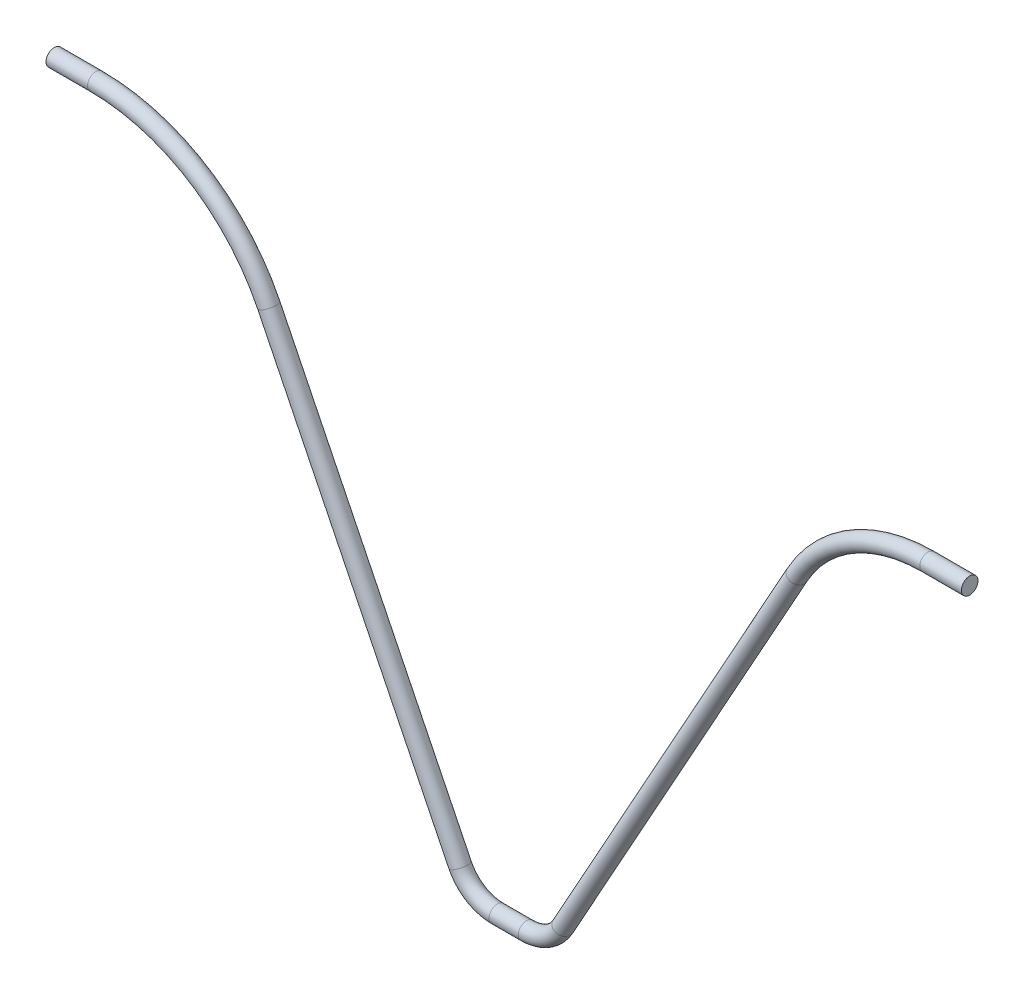
ISO-10303-21;
HEADER;
FILE_DESCRIPTION(('STEP AP214'),'2;1');
FILE_NAME('part.step','',(''),(''),'','','');
FILE_SCHEMA(('AUTOMOTIVE_DESIGN { 1 0 10303 214 1 1 1 1 }'));
ENDSEC;
DATA;
#1=APPLICATION_CONTEXT('core data for automotive mechanical design processes');
#2=APPLICATION_PROTOCOL_DEFINITION('international standard','automotive_design',2000,#1);
#3=PRODUCT_CONTEXT('',#1,'mechanical');
#4=PRODUCT('Part','Part','',(#3));
#5=PRODUCT_RELATED_PRODUCT_CATEGORY('part','',(#4));
#6=PRODUCT_DEFINITION_FORMATION('','',#4);
#7=PRODUCT_DEFINITION_CONTEXT('part definition',#1,'design');
#8=PRODUCT_DEFINITION('design','',#6,#7);
#9=PRODUCT_DEFINITION_SHAPE('','',#8);
#10=(LENGTH_UNIT() NAMED_UNIT(*) SI_UNIT(.MILLI.,.METRE.));
#11=(NAMED_UNIT(*) PLANE_ANGLE_UNIT() SI_UNIT($,.RADIAN.));
#12=(NAMED_UNIT(*) SI_UNIT($,.STERADIAN.) SOLID_ANGLE_UNIT());
#13=UNCERTAINTY_MEASURE_WITH_UNIT(LENGTH_MEASURE(1.E-05),#10,'distance_accuracy_value','');
#14=(GEOMETRIC_REPRESENTATION_CONTEXT(3) GLOBAL_UNCERTAINTY_ASSIGNED_CONTEXT((#13)) GLOBAL_UNIT_ASSIGNED_CONTEXT((#10,
#11,#12)) REPRESENTATION_CONTEXT('',''));
#15=CARTESIAN_POINT('',(0.,0.,0.));
#16=DIRECTION('',(0.,0.,1.));
#17=DIRECTION('',(1.,0.,0.));
#18=AXIS2_PLACEMENT_3D('',#15,#16,#17);
#19=CARTESIAN_POINT('',(-110.,81.0000000000004,0.));
#20=DIRECTION('',(-1.,0.,0.));
#21=DIRECTION('',(0.,0.,1.));
#22=AXIS2_PLACEMENT_3D('',#19,#20,#21);
#23=PLANE('',#22);
#24=CARTESIAN_POINT('',(-110.,81.0000000000004,0.));
#25=DIRECTION('',(-1.,0.,0.));
#26=DIRECTION('',(0.,0.,1.));
#27=AXIS2_PLACEMENT_3D('',#24,#25,#26);
#28=CIRCLE('',#27,2.);
#29=CARTESIAN_POINT('',(-110.,81.0000000000004,2.));
#30=VERTEX_POINT('',#29);
#31=EDGE_CURVE('E81',#30,#30,#28,.T.);
#32=ORIENTED_EDGE('',*,*,#31,.T.);
#33=EDGE_LOOP('',(#32));
#34=FACE_BOUND('',#33,.T.);
#35=ADVANCED_FACE('F47',(#34),#23,.T.);
#36=CARTESIAN_POINT('',(110.,81.0000000000002,0.));
#37=DIRECTION('',(-1.,0.,0.));
#38=DIRECTION('',(0.,0.,1.));
#39=AXIS2_PLACEMENT_3D('',#36,#37,#38);
#40=PLANE('',#39);
#41=CARTESIAN_POINT('',(110.,81.0000000000002,0.));
#42=DIRECTION('',(-1.,0.,0.));
#43=DIRECTION('',(0.,0.,1.));
#44=AXIS2_PLACEMENT_3D('',#41,#42,#43);
#45=CIRCLE('',#44,2.);
#46=CARTESIAN_POINT('',(110.,81.0000000000002,2.));
#47=VERTEX_POINT('',#46);
#48=EDGE_CURVE('E11',#47,#47,#45,.T.);
#49=ORIENTED_EDGE('',*,*,#48,.F.);
#50=EDGE_LOOP('',(#49));
#51=FACE_BOUND('',#50,.T.);
#52=ADVANCED_FACE('F89',(#51),#40,.F.);
#53=CARTESIAN_POINT('',(-110.,81.0000000000004,0.));
#54=DIRECTION('',(1.,0.,0.));
#55=DIRECTION('',(0.,0.,-1.));
#56=AXIS2_PLACEMENT_3D('',#53,#54,#55);
#57=CYLINDRICAL_SURFACE('',#56,2.);
#58=CARTESIAN_POINT('',(-100.,81.0000000000004,0.));
#59=DIRECTION('',(-1.,0.,0.));
#60=DIRECTION('',(0.,0.,1.));
#61=AXIS2_PLACEMENT_3D('',#58,#59,#60);
#62=CIRCLE('',#61,2.);
#63=CARTESIAN_POINT('',(-100.,83.0000000000004,0.));
#64=VERTEX_POINT('',#63);
#65=EDGE_CURVE('E78',#64,#64,#62,.T.);
#66=ORIENTED_EDGE('',*,*,#65,.T.);
#67=EDGE_LOOP('',(#66));
#68=FACE_BOUND('',#67,.T.);
#69=ORIENTED_EDGE('',*,*,#31,.F.);
#70=EDGE_LOOP('',(#69));
#71=FACE_BOUND('',#70,.T.);
#72=ADVANCED_FACE('F86',(#68,#71),#57,.T.);
#73=CARTESIAN_POINT('',(-100.,34.6994535519126,0.));
#74=DIRECTION('',(0.,0.,-1.));
#75=DIRECTION('',(-1.,0.,0.));
#76=AXIS2_PLACEMENT_3D('',#73,#74,#75);
#77=TOROIDAL_SURFACE('',#76,46.3005464480878,2.);
#78=CARTESIAN_POINT('',(-58.4473662808127,55.1229506175617,0.));
#79=DIRECTION('',(-0.441107041545351,0.897454499068955,0.));
#80=DIRECTION('',(0.,0.,1.));
#81=AXIS2_PLACEMENT_3D('',#78,#79,#80);
#82=CIRCLE('',#81,2.);
#83=CARTESIAN_POINT('',(-56.6524572826747,56.0051647006525,0.));
#84=VERTEX_POINT('',#83);
#85=EDGE_CURVE('E75',#84,#84,#82,.T.);
#86=CARTESIAN_POINT('',(-100.,34.6994535519126,0.));
#87=DIRECTION('',(0.,0.,-1.));
#88=DIRECTION('',(-1.,0.,0.));
#89=AXIS2_PLACEMENT_3D('',#86,#87,#88);
#90=CIRCLE('',#89,48.3005464480878);
#91=EDGE_CURVE('',#64,#84,#90,.T.);
#92=ORIENTED_EDGE('',*,*,#65,.F.);
#93=ORIENTED_EDGE('',*,*,#85,.T.);
#94=ORIENTED_EDGE('',*,*,#91,.T.);
#95=ORIENTED_EDGE('',*,*,#91,.F.);
#96=EDGE_LOOP('',(#92,#94,#93,#95));
#97=FACE_BOUND('',#96,.T.);
#98=ADVANCED_FACE('F88',(#97),#77,.T.);
#99=CARTESIAN_POINT('',(-58.4473662808127,55.1229506175617,0.));
#100=DIRECTION('',(0.441107041545352,-0.897454499068954,0.));
#101=DIRECTION('',(0.897454499068954,0.441107041545352,0.));
#102=AXIS2_PLACEMENT_3D('',#99,#100,#101);
#103=CYLINDRICAL_SURFACE('',#102,2.);
#104=CARTESIAN_POINT('',(-12.4745449906895,-38.4110704154533,0.));
#105=DIRECTION('',(-0.441107041545351,0.897454499068954,0.));
#106=DIRECTION('',(0.,0.,1.));
#107=AXIS2_PLACEMENT_3D('',#104,#105,#106);
#108=CIRCLE('',#107,2.);
#109=CARTESIAN_POINT('',(-14.2694539888275,-39.2932844985441,0.));
#110=VERTEX_POINT('',#109);
#111=EDGE_CURVE('E72',#110,#110,#108,.T.);
#112=ORIENTED_EDGE('',*,*,#111,.T.);
#113=EDGE_LOOP('',(#112));
#114=FACE_BOUND('',#113,.T.);
#115=ORIENTED_EDGE('',*,*,#85,.F.);
#116=EDGE_LOOP('',(#115));
#117=FACE_BOUND('',#116,.T.);
#118=ADVANCED_FACE('F96',(#114,#117),#103,.T.);
#119=CARTESIAN_POINT('',(-3.5,-33.9999999999998,0.));
#120=DIRECTION('',(0.,0.,1.));
#121=DIRECTION('',(1.,0.,0.));
#122=AXIS2_PLACEMENT_3D('',#119,#120,#121);
#123=TOROIDAL_SURFACE('',#122,10.,2.);
#124=CARTESIAN_POINT('',(-3.50000000000013,-43.9999999999997,0.));
#125=DIRECTION('',(-1.,0.,0.));
#126=DIRECTION('',(0.,0.,1.));
#127=AXIS2_PLACEMENT_3D('',#124,#125,#126);
#128=CIRCLE('',#127,2.);
#129=CARTESIAN_POINT('',(-3.50000000000015,-45.9999999999998,0.));
#130=VERTEX_POINT('',#129);
#131=EDGE_CURVE('E69',#130,#130,#128,.T.);
#132=CARTESIAN_POINT('',(-3.5,-33.9999999999998,0.));
#133=DIRECTION('',(0.,0.,1.));
#134=DIRECTION('',(1.,0.,0.));
#135=AXIS2_PLACEMENT_3D('',#132,#133,#134);
#136=CIRCLE('',#135,12.);
#137=EDGE_CURVE('',#110,#130,#136,.T.);
#138=ORIENTED_EDGE('',*,*,#111,.F.);
#139=ORIENTED_EDGE('',*,*,#131,.T.);
#140=ORIENTED_EDGE('',*,*,#137,.T.);
#141=ORIENTED_EDGE('',*,*,#137,.F.);
#142=EDGE_LOOP('',(#138,#140,#139,#141));
#143=FACE_BOUND('',#142,.T.);
#144=ADVANCED_FACE('F121',(#143),#123,.T.);
#145=CARTESIAN_POINT('',(-3.50000000000011,-43.9999999999997,0.));
#146=DIRECTION('',(1.,0.,0.));
#147=DIRECTION('',(0.,0.,-1.));
#148=AXIS2_PLACEMENT_3D('',#145,#146,#147);
#149=CYLINDRICAL_SURFACE('',#148,2.);
#150=CARTESIAN_POINT('',(3.49999999999989,-43.9999999999997,0.));
#151=DIRECTION('',(-1.,0.,0.));
#152=DIRECTION('',(0.,0.,1.));
#153=AXIS2_PLACEMENT_3D('',#150,#151,#152);
#154=CIRCLE('',#153,2.);
#155=CARTESIAN_POINT('',(3.49999999999987,-45.9999999999996,0.));
#156=VERTEX_POINT('',#155);
#157=EDGE_CURVE('E66',#156,#156,#154,.T.);
#158=ORIENTED_EDGE('',*,*,#157,.T.);
#159=EDGE_LOOP('',(#158));
#160=FACE_BOUND('',#159,.T.);
#161=ORIENTED_EDGE('',*,*,#131,.F.);
#162=EDGE_LOOP('',(#161));
#163=FACE_BOUND('',#162,.T.);
#164=ADVANCED_FACE('F117',(#160,#163),#149,.T.);
#165=CARTESIAN_POINT('',(3.5,-33.9999999999998,0.));
#166=DIRECTION('',(0.,0.,1.));
#167=DIRECTION('',(1.,0.,0.));
#168=AXIS2_PLACEMENT_3D('',#165,#166,#167);
#169=TOROIDAL_SURFACE('',#168,9.99999999999983,2.);
#170=CARTESIAN_POINT('',(12.2423402455972,-38.8550475826926,0.));
#171=DIRECTION('',(-0.485504758269285,-0.874234024559719,0.));
#172=DIRECTION('',(0.,0.,1.));
#173=AXIS2_PLACEMENT_3D('',#170,#171,#172);
#174=CIRCLE('',#173,2.);
#175=CARTESIAN_POINT('',(13.9908082947165,-39.8260570992311,0.));
#176=VERTEX_POINT('',#175);
#177=EDGE_CURVE('E61',#176,#176,#174,.T.);
#178=CARTESIAN_POINT('',(3.5,-33.9999999999998,0.));
#179=DIRECTION('',(0.,0.,1.));
#180=DIRECTION('',(1.,0.,0.));
#181=AXIS2_PLACEMENT_3D('',#178,#179,#180);
#182=CIRCLE('',#181,11.9999999999998);
#183=EDGE_CURVE('',#156,#176,#182,.T.);
#184=ORIENTED_EDGE('',*,*,#157,.F.);
#185=ORIENTED_EDGE('',*,*,#177,.T.);
#186=ORIENTED_EDGE('',*,*,#183,.T.);
#187=ORIENTED_EDGE('',*,*,#183,.F.);
#188=EDGE_LOOP('',(#184,#186,#185,#187));
#189=FACE_BOUND('',#188,.T.);
#190=ADVANCED_FACE('F113',(#189),#169,.T.);
#191=CARTESIAN_POINT('',(12.2423402455972,-38.8550475826926,0.));
#192=DIRECTION('',(0.485504758269283,0.87423402455972,0.));
#193=DIRECTION('',(-0.87423402455972,0.485504758269283,0.));
#194=AXIS2_PLACEMENT_3D('',#191,#192,#193);
#195=CYLINDRICAL_SURFACE('',#194,2.);
#196=CARTESIAN_POINT('',(68.5127793255803,62.4694638309548,0.));
#197=DIRECTION('',(-0.485504758269285,-0.874234024559719,0.));
#198=DIRECTION('',(0.,0.,1.));
#199=AXIS2_PLACEMENT_3D('',#196,#197,#198);
#200=CIRCLE('',#199,2.);
#201=CARTESIAN_POINT('',(66.7643112764608,63.4404733474934,0.));
#202=VERTEX_POINT('',#201);
#203=EDGE_CURVE('E57',#202,#202,#200,.T.);
#204=ORIENTED_EDGE('',*,*,#203,.T.);
#205=EDGE_LOOP('',(#204));
#206=FACE_BOUND('',#205,.T.);
#207=ORIENTED_EDGE('',*,*,#177,.F.);
#208=EDGE_LOOP('',(#207));
#209=FACE_BOUND('',#208,.T.);
#210=ADVANCED_FACE('F107',(#206,#209),#195,.T.);
#211=CARTESIAN_POINT('',(100.,44.983075709874,0.));
#212=DIRECTION('',(0.,0.,-1.));
#213=DIRECTION('',(-1.,0.,0.));
#214=AXIS2_PLACEMENT_3D('',#211,#212,#213);
#215=TOROIDAL_SURFACE('',#214,36.0169242901262,2.);
#216=CARTESIAN_POINT('',(99.9999999999999,81.0000000000003,0.));
#217=DIRECTION('',(-1.,0.,0.));
#218=DIRECTION('',(0.,0.,1.));
#219=AXIS2_PLACEMENT_3D('',#216,#217,#218);
#220=CIRCLE('',#219,2.);
#221=CARTESIAN_POINT('',(99.9999999999999,83.0000000000002,0.));
#222=VERTEX_POINT('',#221);
#223=EDGE_CURVE('E53',#222,#222,#220,.T.);
#224=CARTESIAN_POINT('',(100.,44.983075709874,0.));
#225=DIRECTION('',(0.,0.,-1.));
#226=DIRECTION('',(-1.,0.,0.));
#227=AXIS2_PLACEMENT_3D('',#224,#225,#226);
#228=CIRCLE('',#227,38.0169242901262);
#229=EDGE_CURVE('',#202,#222,#228,.T.);
#230=ORIENTED_EDGE('',*,*,#203,.F.);
#231=ORIENTED_EDGE('',*,*,#223,.T.);
#232=ORIENTED_EDGE('',*,*,#229,.T.);
#233=ORIENTED_EDGE('',*,*,#229,.F.);
#234=EDGE_LOOP('',(#230,#232,#231,#233));
#235=FACE_BOUND('',#234,.T.);
#236=ADVANCED_FACE('F102',(#235),#215,.T.);
#237=CARTESIAN_POINT('',(100.,81.0000000000002,0.));
#238=DIRECTION('',(1.,0.,0.));
#239=DIRECTION('',(0.,1.,0.));
#240=AXIS2_PLACEMENT_3D('',#237,#238,#239);
#241=CYLINDRICAL_SURFACE('',#240,2.);
#242=ORIENTED_EDGE('',*,*,#48,.T.);
#243=EDGE_LOOP('',(#242));
#244=FACE_BOUND('',#243,.T.);
#245=ORIENTED_EDGE('',*,*,#223,.F.);
#246=EDGE_LOOP('',(#245));
#247=FACE_BOUND('',#246,.T.);
#248=ADVANCED_FACE('F100',(#244,#247),#241,.T.);
#249=CLOSED_SHELL('',(#35,#52,#72,#98,#118,#144,#164,#190,#210,#236,#248));
#250=MANIFOLD_SOLID_BREP('B2',#249);
#251=ADVANCED_BREP_SHAPE_REPRESENTATION('',(#18,#250),#14);
#252=SHAPE_DEFINITION_REPRESENTATION(#9,#251);
ENDSEC;
END-ISO-10303-21;
